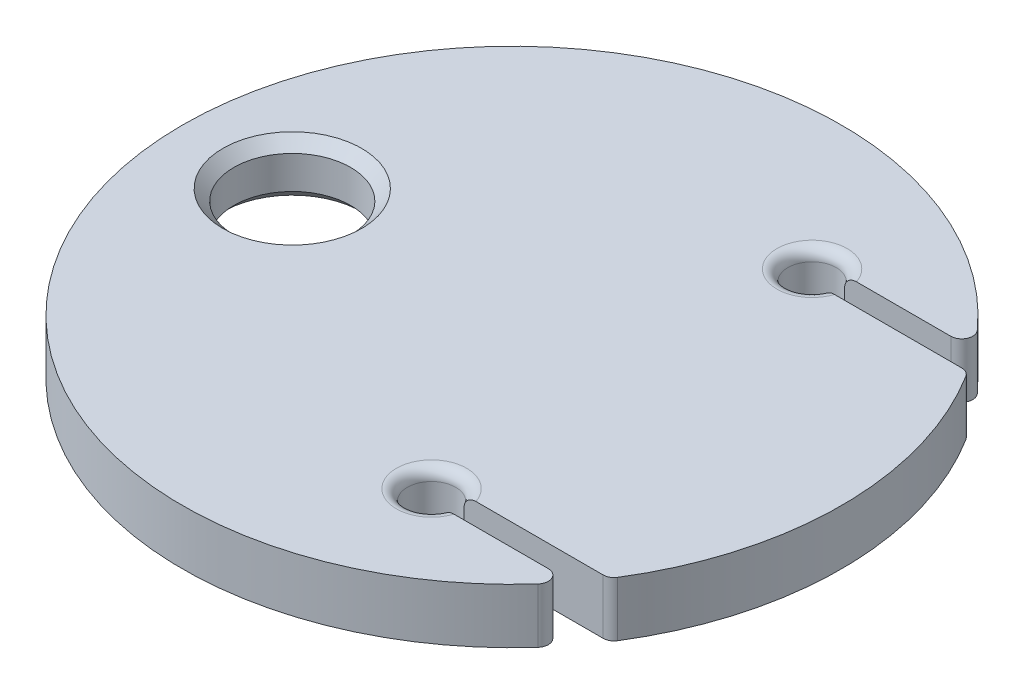
ISO-10303-21;
HEADER;
FILE_DESCRIPTION(('STEP AP214'),'2;1');
FILE_NAME('part.step','',(''),(''),'','','');
FILE_SCHEMA(('AUTOMOTIVE_DESIGN { 1 0 10303 214 1 1 1 1 }'));
ENDSEC;
DATA;
#1=APPLICATION_CONTEXT('core data for automotive mechanical design processes');
#2=APPLICATION_PROTOCOL_DEFINITION('international standard','automotive_design',2000,#1);
#3=PRODUCT_CONTEXT('',#1,'mechanical');
#4=PRODUCT('Part','Part','',(#3));
#5=PRODUCT_RELATED_PRODUCT_CATEGORY('part','',(#4));
#6=PRODUCT_DEFINITION_FORMATION('','',#4);
#7=PRODUCT_DEFINITION_CONTEXT('part definition',#1,'design');
#8=PRODUCT_DEFINITION('design','',#6,#7);
#9=PRODUCT_DEFINITION_SHAPE('','',#8);
#10=(LENGTH_UNIT() NAMED_UNIT(*) SI_UNIT(.MILLI.,.METRE.));
#11=(NAMED_UNIT(*) PLANE_ANGLE_UNIT() SI_UNIT($,.RADIAN.));
#12=(NAMED_UNIT(*) SI_UNIT($,.STERADIAN.) SOLID_ANGLE_UNIT());
#13=UNCERTAINTY_MEASURE_WITH_UNIT(LENGTH_MEASURE(1.E-05),#10,'distance_accuracy_value','');
#14=(GEOMETRIC_REPRESENTATION_CONTEXT(3) GLOBAL_UNCERTAINTY_ASSIGNED_CONTEXT((#13)) GLOBAL_UNIT_ASSIGNED_CONTEXT((#10,
#11,#12)) REPRESENTATION_CONTEXT('',''));
#15=CARTESIAN_POINT('',(0.,0.,0.));
#16=DIRECTION('',(0.,0.,1.));
#17=DIRECTION('',(1.,0.,0.));
#18=AXIS2_PLACEMENT_3D('',#15,#16,#17);
#19=CARTESIAN_POINT('',(0.,3.175,0.));
#20=DIRECTION('',(0.,-1.,0.));
#21=DIRECTION('',(0.,0.,-1.));
#22=AXIS2_PLACEMENT_3D('',#19,#20,#21);
#23=CYLINDRICAL_SURFACE('',#22,19.05);
#24=CARTESIAN_POINT('',(0.,0.,0.));
#25=DIRECTION('',(0.,1.,0.));
#26=DIRECTION('',(0.,0.,1.));
#27=AXIS2_PLACEMENT_3D('',#24,#25,#26);
#28=CIRCLE('',#27,19.05);
#29=CARTESIAN_POINT('',(16.1746291118457,0.,10.0639889255818));
#30=VERTEX_POINT('',#29);
#31=CARTESIAN_POINT('',(16.1746291118457,0.,-10.0639889255818));
#32=VERTEX_POINT('',#31);
#33=EDGE_CURVE('E316',#30,#32,#28,.T.);
#34=ORIENTED_EDGE('',*,*,#33,.T.);
#35=DIRECTION('',(0.,-1.,0.));
#36=VECTOR('',#35,1.);
#37=CARTESIAN_POINT('',(16.1746291118457,3.175,-10.0639889255818));
#38=LINE('',#37,#36);
#39=CARTESIAN_POINT('',(16.1746291118457,3.175,-10.0639889255818));
#40=VERTEX_POINT('',#39);
#41=EDGE_CURVE('E353',#32,#40,#38,.F.);
#42=ORIENTED_EDGE('',*,*,#41,.T.);
#43=CARTESIAN_POINT('',(0.,3.175,0.));
#44=DIRECTION('',(0.,1.,0.));
#45=DIRECTION('',(0.,0.,1.));
#46=AXIS2_PLACEMENT_3D('',#43,#44,#45);
#47=CIRCLE('',#46,19.05);
#48=CARTESIAN_POINT('',(16.1746291118457,3.175,10.0639889255818));
#49=VERTEX_POINT('',#48);
#50=EDGE_CURVE('E315',#49,#40,#47,.T.);
#51=ORIENTED_EDGE('',*,*,#50,.F.);
#52=DIRECTION('',(0.,-1.,0.));
#53=VECTOR('',#52,1.);
#54=CARTESIAN_POINT('',(16.1746291118457,3.175,10.0639889255818));
#55=LINE('',#54,#53);
#56=EDGE_CURVE('E420',#49,#30,#55,.T.);
#57=ORIENTED_EDGE('',*,*,#56,.T.);
#58=EDGE_LOOP('',(#34,#42,#51,#57));
#59=FACE_BOUND('',#58,.T.);
#60=ADVANCED_FACE('F35',(#59),#23,.T.);
#61=CARTESIAN_POINT('',(14.2065625911639,3.175,-12.6915751324783));
#62=VERTEX_POINT('',#61);
#63=CARTESIAN_POINT('',(14.2065625911639,3.175,12.6915751324783));
#64=VERTEX_POINT('',#63);
#65=EDGE_CURVE('E312',#62,#64,#47,.T.);
#66=ORIENTED_EDGE('',*,*,#65,.F.);
#67=DIRECTION('',(0.,-1.,0.));
#68=VECTOR('',#67,1.);
#69=CARTESIAN_POINT('',(14.2065625911639,3.175,-12.6915751324783));
#70=LINE('',#69,#68);
#71=CARTESIAN_POINT('',(14.2065625911639,0.,-12.6915751324783));
#72=VERTEX_POINT('',#71);
#73=EDGE_CURVE('E404',#62,#72,#70,.T.);
#74=ORIENTED_EDGE('',*,*,#73,.T.);
#75=CARTESIAN_POINT('',(14.2065625911639,0.,12.6915751324783));
#76=VERTEX_POINT('',#75);
#77=EDGE_CURVE('E311',#72,#76,#28,.T.);
#78=ORIENTED_EDGE('',*,*,#77,.T.);
#79=DIRECTION('',(0.,-1.,0.));
#80=VECTOR('',#79,1.);
#81=CARTESIAN_POINT('',(14.2065625911639,3.175,12.6915751324783));
#82=LINE('',#81,#80);
#83=EDGE_CURVE('E402',#76,#64,#82,.F.);
#84=ORIENTED_EDGE('',*,*,#83,.T.);
#85=EDGE_LOOP('',(#66,#74,#78,#84));
#86=FACE_BOUND('',#85,.T.);
#87=ADVANCED_FACE('F245',(#86),#23,.T.);
#88=CARTESIAN_POINT('',(0.,3.175,0.));
#89=DIRECTION('',(0.,1.,0.));
#90=DIRECTION('',(0.,0.,1.));
#91=AXIS2_PLACEMENT_3D('',#88,#89,#90);
#92=PLANE('',#91);
#93=CARTESIAN_POINT('',(-12.7,3.175,0.));
#94=DIRECTION('',(0.,1.,0.));
#95=DIRECTION('',(0.,0.,1.));
#96=AXIS2_PLACEMENT_3D('',#93,#94,#95);
#97=CIRCLE('',#96,4.01319999999999);
#98=CARTESIAN_POINT('',(-12.7,3.175,4.01319999999999));
#99=VERTEX_POINT('',#98);
#100=EDGE_CURVE('E325',#99,#99,#97,.F.);
#101=ORIENTED_EDGE('',*,*,#100,.T.);
#102=EDGE_LOOP('',(#101));
#103=FACE_BOUND('',#102,.T.);
#104=DIRECTION('',(1.,0.,0.));
#105=VECTOR('',#104,1.);
#106=CARTESIAN_POINT('',(0.,3.175,-11.6335226280624));
#107=LINE('',#106,#105);
#108=CARTESIAN_POINT('',(8.28023288750347,3.175,-11.6335226280624));
#109=VERTEX_POINT('',#108);
#110=CARTESIAN_POINT('',(13.7330105047918,3.175,-11.6335226280624));
#111=VERTEX_POINT('',#110);
#112=EDGE_CURVE('E154',#109,#111,#107,.T.);
#113=ORIENTED_EDGE('',*,*,#112,.T.);
#114=CARTESIAN_POINT('',(13.7330105047918,3.175,-12.2685226280624));
#115=DIRECTION('',(0.,1.,0.));
#116=DIRECTION('',(0.,0.,1.));
#117=AXIS2_PLACEMENT_3D('',#114,#115,#116);
#118=CIRCLE('',#117,0.635);
#119=EDGE_CURVE('E400',#111,#62,#118,.T.);
#120=ORIENTED_EDGE('',*,*,#119,.T.);
#121=ORIENTED_EDGE('',*,*,#65,.T.);
#122=CARTESIAN_POINT('',(13.7330105047918,3.175,12.2685226280624));
#123=DIRECTION('',(0.,1.,0.));
#124=DIRECTION('',(0.,0.,1.));
#125=AXIS2_PLACEMENT_3D('',#122,#123,#124);
#126=CIRCLE('',#125,0.635);
#127=CARTESIAN_POINT('',(13.7330105047918,3.175,11.6335226280624));
#128=VERTEX_POINT('',#127);
#129=EDGE_CURVE('E159',#64,#128,#126,.T.);
#130=ORIENTED_EDGE('',*,*,#129,.T.);
#131=DIRECTION('',(-1.,0.,0.));
#132=VECTOR('',#131,1.);
#133=CARTESIAN_POINT('',(0.,3.175,11.6335226280624));
#134=LINE('',#133,#132);
#135=CARTESIAN_POINT('',(8.28023288750347,3.175,11.6335226280624));
#136=VERTEX_POINT('',#135);
#137=EDGE_CURVE('E388',#128,#136,#134,.T.);
#138=ORIENTED_EDGE('',*,*,#137,.T.);
#139=CARTESIAN_POINT('',(6.35,3.175,10.9985226280624));
#140=DIRECTION('',(0.,1.,0.));
#141=DIRECTION('',(0.,0.,1.));
#142=AXIS2_PLACEMENT_3D('',#139,#140,#141);
#143=CIRCLE('',#142,2.032);
#144=CARTESIAN_POINT('',(8.28023288750347,3.175,10.3635226280624));
#145=VERTEX_POINT('',#144);
#146=EDGE_CURVE('E160',#136,#145,#143,.F.);
#147=ORIENTED_EDGE('',*,*,#146,.T.);
#148=DIRECTION('',(1.,0.,0.));
#149=VECTOR('',#148,1.);
#150=CARTESIAN_POINT('',(0.,3.175,10.3635226280624));
#151=LINE('',#150,#149);
#152=CARTESIAN_POINT('',(15.6354748081175,3.175,10.3635226280624));
#153=VERTEX_POINT('',#152);
#154=EDGE_CURVE('E302',#145,#153,#151,.T.);
#155=ORIENTED_EDGE('',*,*,#154,.T.);
#156=CARTESIAN_POINT('',(15.6354748081175,3.175,9.72852262806236));
#157=DIRECTION('',(0.,1.,0.));
#158=DIRECTION('',(0.,0.,1.));
#159=AXIS2_PLACEMENT_3D('',#156,#157,#158);
#160=CIRCLE('',#159,0.635);
#161=EDGE_CURVE('E396',#153,#49,#160,.T.);
#162=ORIENTED_EDGE('',*,*,#161,.T.);
#163=ORIENTED_EDGE('',*,*,#50,.T.);
#164=CARTESIAN_POINT('',(15.6354748081175,3.175,-9.72852262806236));
#165=DIRECTION('',(0.,1.,0.));
#166=DIRECTION('',(0.,0.,1.));
#167=AXIS2_PLACEMENT_3D('',#164,#165,#166);
#168=CIRCLE('',#167,0.635);
#169=CARTESIAN_POINT('',(15.6354748081175,3.175,-10.3635226280624));
#170=VERTEX_POINT('',#169);
#171=EDGE_CURVE('E398',#40,#170,#168,.T.);
#172=ORIENTED_EDGE('',*,*,#171,.T.);
#173=DIRECTION('',(-1.,0.,0.));
#174=VECTOR('',#173,1.);
#175=CARTESIAN_POINT('',(0.,3.175,-10.3635226280624));
#176=LINE('',#175,#174);
#177=CARTESIAN_POINT('',(8.28023288750347,3.175,-10.3635226280624));
#178=VERTEX_POINT('',#177);
#179=EDGE_CURVE('E156',#170,#178,#176,.T.);
#180=ORIENTED_EDGE('',*,*,#179,.T.);
#181=CARTESIAN_POINT('',(6.35,3.175,-10.9985226280624));
#182=DIRECTION('',(0.,1.,0.));
#183=DIRECTION('',(0.,0.,1.));
#184=AXIS2_PLACEMENT_3D('',#181,#182,#183);
#185=CIRCLE('',#184,2.032);
#186=EDGE_CURVE('E151',#178,#109,#185,.F.);
#187=ORIENTED_EDGE('',*,*,#186,.T.);
#188=EDGE_LOOP('',(#113,#120,#121,#130,#138,#147,#155,#162,#163,#172,#180,#187));
#189=FACE_BOUND('',#188,.T.);
#190=ADVANCED_FACE('F153',(#103,#189),#92,.T.);
#191=CARTESIAN_POINT('',(0.,0.,0.));
#192=DIRECTION('',(0.,1.,0.));
#193=DIRECTION('',(0.,0.,1.));
#194=AXIS2_PLACEMENT_3D('',#191,#192,#193);
#195=PLANE('',#194);
#196=CARTESIAN_POINT('',(-12.7,0.,0.));
#197=DIRECTION('',(0.,1.,0.));
#198=DIRECTION('',(0.,0.,1.));
#199=AXIS2_PLACEMENT_3D('',#196,#197,#198);
#200=CIRCLE('',#199,4.0132);
#201=CARTESIAN_POINT('',(-12.7,0.,4.0132));
#202=VERTEX_POINT('',#201);
#203=EDGE_CURVE('E328',#202,#202,#200,.T.);
#204=ORIENTED_EDGE('',*,*,#203,.T.);
#205=EDGE_LOOP('',(#204));
#206=FACE_BOUND('',#205,.T.);
#207=ORIENTED_EDGE('',*,*,#77,.F.);
#208=CARTESIAN_POINT('',(13.7330105047918,0.,-12.2685226280624));
#209=DIRECTION('',(0.,1.,0.));
#210=DIRECTION('',(0.,0.,1.));
#211=AXIS2_PLACEMENT_3D('',#208,#209,#210);
#212=CIRCLE('',#211,0.635);
#213=CARTESIAN_POINT('',(13.7330105047918,0.,-11.6335226280624));
#214=VERTEX_POINT('',#213);
#215=EDGE_CURVE('E215',#72,#214,#212,.F.);
#216=ORIENTED_EDGE('',*,*,#215,.T.);
#217=DIRECTION('',(1.,0.,0.));
#218=VECTOR('',#217,1.);
#219=CARTESIAN_POINT('',(0.,0.,-11.6335226280624));
#220=LINE('',#219,#218);
#221=CARTESIAN_POINT('',(8.28023288750347,0.,-11.6335226280624));
#222=VERTEX_POINT('',#221);
#223=EDGE_CURVE('E172',#222,#214,#220,.T.);
#224=ORIENTED_EDGE('',*,*,#223,.F.);
#225=CARTESIAN_POINT('',(6.35,0.,-10.9985226280624));
#226=DIRECTION('',(0.,1.,0.));
#227=DIRECTION('',(0.,0.,1.));
#228=AXIS2_PLACEMENT_3D('',#225,#226,#227);
#229=CIRCLE('',#228,2.032);
#230=CARTESIAN_POINT('',(8.28023288750347,0.,-10.3635226280624));
#231=VERTEX_POINT('',#230);
#232=EDGE_CURVE('E295',#222,#231,#229,.T.);
#233=ORIENTED_EDGE('',*,*,#232,.T.);
#234=DIRECTION('',(-1.,0.,0.));
#235=VECTOR('',#234,1.);
#236=CARTESIAN_POINT('',(0.,0.,-10.3635226280624));
#237=LINE('',#236,#235);
#238=CARTESIAN_POINT('',(15.6354748081175,0.,-10.3635226280624));
#239=VERTEX_POINT('',#238);
#240=EDGE_CURVE('E171',#239,#231,#237,.T.);
#241=ORIENTED_EDGE('',*,*,#240,.F.);
#242=CARTESIAN_POINT('',(15.6354748081175,0.,-9.72852262806236));
#243=DIRECTION('',(0.,1.,0.));
#244=DIRECTION('',(0.,0.,1.));
#245=AXIS2_PLACEMENT_3D('',#242,#243,#244);
#246=CIRCLE('',#245,0.635);
#247=EDGE_CURVE('E411',#239,#32,#246,.F.);
#248=ORIENTED_EDGE('',*,*,#247,.T.);
#249=ORIENTED_EDGE('',*,*,#33,.F.);
#250=CARTESIAN_POINT('',(15.6354748081175,0.,9.72852262806236));
#251=DIRECTION('',(0.,1.,0.));
#252=DIRECTION('',(0.,0.,1.));
#253=AXIS2_PLACEMENT_3D('',#250,#251,#252);
#254=CIRCLE('',#253,0.635);
#255=CARTESIAN_POINT('',(15.6354748081175,0.,10.3635226280624));
#256=VERTEX_POINT('',#255);
#257=EDGE_CURVE('E410',#30,#256,#254,.F.);
#258=ORIENTED_EDGE('',*,*,#257,.T.);
#259=DIRECTION('',(1.,0.,0.));
#260=VECTOR('',#259,1.);
#261=CARTESIAN_POINT('',(0.,0.,10.3635226280624));
#262=LINE('',#261,#260);
#263=CARTESIAN_POINT('',(8.28023288750347,0.,10.3635226280624));
#264=VERTEX_POINT('',#263);
#265=EDGE_CURVE('E305',#264,#256,#262,.T.);
#266=ORIENTED_EDGE('',*,*,#265,.F.);
#267=CARTESIAN_POINT('',(6.35,0.,10.9985226280624));
#268=DIRECTION('',(0.,1.,0.));
#269=DIRECTION('',(0.,0.,1.));
#270=AXIS2_PLACEMENT_3D('',#267,#268,#269);
#271=CIRCLE('',#270,2.032);
#272=CARTESIAN_POINT('',(8.28023288750347,0.,11.6335226280624));
#273=VERTEX_POINT('',#272);
#274=EDGE_CURVE('E348',#264,#273,#271,.T.);
#275=ORIENTED_EDGE('',*,*,#274,.T.);
#276=DIRECTION('',(-1.,0.,0.));
#277=VECTOR('',#276,1.);
#278=CARTESIAN_POINT('',(0.,0.,11.6335226280624));
#279=LINE('',#278,#277);
#280=CARTESIAN_POINT('',(13.7330105047918,0.,11.6335226280624));
#281=VERTEX_POINT('',#280);
#282=EDGE_CURVE('E391',#281,#273,#279,.T.);
#283=ORIENTED_EDGE('',*,*,#282,.F.);
#284=CARTESIAN_POINT('',(13.7330105047918,0.,12.2685226280624));
#285=DIRECTION('',(0.,1.,0.));
#286=DIRECTION('',(0.,0.,1.));
#287=AXIS2_PLACEMENT_3D('',#284,#285,#286);
#288=CIRCLE('',#287,0.635);
#289=EDGE_CURVE('E408',#281,#76,#288,.F.);
#290=ORIENTED_EDGE('',*,*,#289,.T.);
#291=EDGE_LOOP('',(#207,#216,#224,#233,#241,#248,#249,#258,#266,#275,#283,#290));
#292=FACE_BOUND('',#291,.T.);
#293=ADVANCED_FACE('F237',(#206,#292),#195,.F.);
#294=CARTESIAN_POINT('',(6.35,3.175,-10.9985226280624));
#295=DIRECTION('',(0.,1.,0.));
#296=DIRECTION('',(0.,0.,1.));
#297=AXIS2_PLACEMENT_3D('',#294,#295,#296);
#298=CYLINDRICAL_SURFACE('',#297,1.397);
#299=DIRECTION('',(0.,1.,0.));
#300=VECTOR('',#299,1.);
#301=CARTESIAN_POINT('',(7.59434078933385,3.175,-10.3635226280624));
#302=LINE('',#301,#300);
#303=CARTESIAN_POINT('',(7.59434078933385,0.635,-10.3635226280624));
#304=VERTEX_POINT('',#303);
#305=CARTESIAN_POINT('',(7.59434078933385,2.54,-10.3635226280624));
#306=VERTEX_POINT('',#305);
#307=EDGE_CURVE('E179',#304,#306,#302,.T.);
#308=ORIENTED_EDGE('',*,*,#307,.F.);
#309=CARTESIAN_POINT('',(6.35,0.635,-10.9985226280624));
#310=DIRECTION('',(0.,1.,0.));
#311=DIRECTION('',(0.,0.,1.));
#312=AXIS2_PLACEMENT_3D('',#309,#310,#311);
#313=CIRCLE('',#312,1.397);
#314=CARTESIAN_POINT('',(7.59434078933386,0.635,-11.6335226280624));
#315=VERTEX_POINT('',#314);
#316=EDGE_CURVE('E293',#304,#315,#313,.F.);
#317=ORIENTED_EDGE('',*,*,#316,.T.);
#318=DIRECTION('',(0.,1.,0.));
#319=VECTOR('',#318,1.);
#320=CARTESIAN_POINT('',(7.59434078933386,3.175,-11.6335226280624));
#321=LINE('',#320,#319);
#322=CARTESIAN_POINT('',(7.59434078933386,2.54,-11.6335226280624));
#323=VERTEX_POINT('',#322);
#324=EDGE_CURVE('E183',#323,#315,#321,.F.);
#325=ORIENTED_EDGE('',*,*,#324,.F.);
#326=CARTESIAN_POINT('',(6.35,2.54,-10.9985226280624));
#327=DIRECTION('',(0.,1.,0.));
#328=DIRECTION('',(0.,0.,1.));
#329=AXIS2_PLACEMENT_3D('',#326,#327,#328);
#330=CIRCLE('',#329,1.397);
#331=EDGE_CURVE('E177',#323,#306,#330,.T.);
#332=ORIENTED_EDGE('',*,*,#331,.T.);
#333=EDGE_LOOP('',(#308,#317,#325,#332));
#334=FACE_BOUND('',#333,.T.);
#335=ADVANCED_FACE('F233',(#334),#298,.F.);
#336=CARTESIAN_POINT('',(6.35,3.175,10.9985226280624));
#337=DIRECTION('',(0.,1.,0.));
#338=DIRECTION('',(0.,0.,1.));
#339=AXIS2_PLACEMENT_3D('',#336,#337,#338);
#340=CYLINDRICAL_SURFACE('',#339,1.397);
#341=DIRECTION('',(0.,1.,0.));
#342=VECTOR('',#341,1.);
#343=CARTESIAN_POINT('',(7.59434078933385,3.175,11.6335226280624));
#344=LINE('',#343,#342);
#345=CARTESIAN_POINT('',(7.59434078933385,0.635,11.6335226280624));
#346=VERTEX_POINT('',#345);
#347=CARTESIAN_POINT('',(7.59434078933385,2.54,11.6335226280624));
#348=VERTEX_POINT('',#347);
#349=EDGE_CURVE('E331',#346,#348,#344,.T.);
#350=ORIENTED_EDGE('',*,*,#349,.F.);
#351=CARTESIAN_POINT('',(6.35,0.635,10.9985226280624));
#352=DIRECTION('',(0.,1.,0.));
#353=DIRECTION('',(0.,0.,1.));
#354=AXIS2_PLACEMENT_3D('',#351,#352,#353);
#355=CIRCLE('',#354,1.397);
#356=CARTESIAN_POINT('',(7.59434078933385,0.635,10.3635226280624));
#357=VERTEX_POINT('',#356);
#358=EDGE_CURVE('E11',#346,#357,#355,.F.);
#359=ORIENTED_EDGE('',*,*,#358,.T.);
#360=DIRECTION('',(0.,1.,0.));
#361=VECTOR('',#360,1.);
#362=CARTESIAN_POINT('',(7.59434078933385,3.175,10.3635226280624));
#363=LINE('',#362,#361);
#364=CARTESIAN_POINT('',(7.59434078933385,2.54,10.3635226280624));
#365=VERTEX_POINT('',#364);
#366=EDGE_CURVE('E333',#365,#357,#363,.F.);
#367=ORIENTED_EDGE('',*,*,#366,.F.);
#368=CARTESIAN_POINT('',(6.35,2.54,10.9985226280624));
#369=DIRECTION('',(0.,1.,0.));
#370=DIRECTION('',(0.,0.,1.));
#371=AXIS2_PLACEMENT_3D('',#368,#369,#370);
#372=CIRCLE('',#371,1.397);
#373=EDGE_CURVE('E44',#365,#348,#372,.T.);
#374=ORIENTED_EDGE('',*,*,#373,.T.);
#375=EDGE_LOOP('',(#350,#359,#367,#374));
#376=FACE_BOUND('',#375,.T.);
#377=ADVANCED_FACE('F228',(#376),#340,.F.);
#378=CARTESIAN_POINT('',(-12.7,3.175,0.));
#379=DIRECTION('',(0.,1.,0.));
#380=DIRECTION('',(0.,0.,1.));
#381=AXIS2_PLACEMENT_3D('',#378,#379,#380);
#382=CYLINDRICAL_SURFACE('',#381,3.37819999999999);
#383=CARTESIAN_POINT('',(-12.7,2.54000000000001,0.));
#384=DIRECTION('',(0.,1.,0.));
#385=DIRECTION('',(0.,0.,1.));
#386=AXIS2_PLACEMENT_3D('',#383,#384,#385);
#387=CIRCLE('',#386,3.37819999999999);
#388=CARTESIAN_POINT('',(-12.7,2.54000000000001,3.37819999999999));
#389=VERTEX_POINT('',#388);
#390=EDGE_CURVE('E322',#389,#389,#387,.T.);
#391=ORIENTED_EDGE('',*,*,#390,.T.);
#392=EDGE_LOOP('',(#391));
#393=FACE_BOUND('',#392,.T.);
#394=CARTESIAN_POINT('',(-12.7,0.635000000000012,0.));
#395=DIRECTION('',(0.,1.,0.));
#396=DIRECTION('',(0.,0.,1.));
#397=AXIS2_PLACEMENT_3D('',#394,#395,#396);
#398=CIRCLE('',#397,3.37819999999999);
#399=CARTESIAN_POINT('',(-12.7,0.635000000000012,3.37819999999999));
#400=VERTEX_POINT('',#399);
#401=EDGE_CURVE('E319',#400,#400,#398,.F.);
#402=ORIENTED_EDGE('',*,*,#401,.T.);
#403=EDGE_LOOP('',(#402));
#404=FACE_BOUND('',#403,.T.);
#405=ADVANCED_FACE('F232',(#393,#404),#382,.F.);
#406=CARTESIAN_POINT('',(-12.7,2.54000000000001,0.));
#407=DIRECTION('',(0.,1.,0.));
#408=DIRECTION('',(0.,0.,1.));
#409=AXIS2_PLACEMENT_3D('',#406,#407,#408);
#410=CONICAL_SURFACE('',#409,3.37819999999999,0.78539816339745);
#411=ORIENTED_EDGE('',*,*,#100,.F.);
#412=EDGE_LOOP('',(#411));
#413=FACE_BOUND('',#412,.T.);
#414=ORIENTED_EDGE('',*,*,#390,.F.);
#415=EDGE_LOOP('',(#414));
#416=FACE_BOUND('',#415,.T.);
#417=ADVANCED_FACE('F241',(#413,#416),#410,.F.);
#418=CARTESIAN_POINT('',(-12.7,0.,0.));
#419=DIRECTION('',(0.,-1.,0.));
#420=DIRECTION('',(0.,0.,-1.));
#421=AXIS2_PLACEMENT_3D('',#418,#419,#420);
#422=CONICAL_SURFACE('',#421,4.0132,0.785398163397447);
#423=ORIENTED_EDGE('',*,*,#401,.F.);
#424=EDGE_LOOP('',(#423));
#425=FACE_BOUND('',#424,.T.);
#426=ORIENTED_EDGE('',*,*,#203,.F.);
#427=EDGE_LOOP('',(#426));
#428=FACE_BOUND('',#427,.T.);
#429=ADVANCED_FACE('F259',(#425,#428),#422,.F.);
#430=CARTESIAN_POINT('',(19.05,9.525,11.6335226280624));
#431=DIRECTION('',(0.,0.,-1.));
#432=DIRECTION('',(0.,1.,0.));
#433=AXIS2_PLACEMENT_3D('',#430,#431,#432);
#434=PLANE('',#433);
#435=ORIENTED_EDGE('',*,*,#137,.F.);
#436=DIRECTION('',(0.,1.,0.));
#437=VECTOR('',#436,1.);
#438=CARTESIAN_POINT('',(13.7330105047918,0.,11.6335226280624));
#439=LINE('',#438,#437);
#440=EDGE_CURVE('E382',#128,#281,#439,.F.);
#441=ORIENTED_EDGE('',*,*,#440,.T.);
#442=ORIENTED_EDGE('',*,*,#282,.T.);
#443=CARTESIAN_POINT('',(8.28023288750347,0.,11.6335226280624));
#444=CARTESIAN_POINT('',(8.24003438690035,-2.21269320664593E-05,11.6335226280624));
#445=CARTESIAN_POINT('',(8.19985840934196,0.00344295336007163,11.6335226280624));
#446=CARTESIAN_POINT('',(8.12066870343848,0.0170431238652638,11.6335226280624));
#447=CARTESIAN_POINT('',(8.08165441852798,0.0271749644950025,11.6335226280624));
#448=CARTESIAN_POINT('',(8.00586239124069,0.0538053842673953,11.6335226280624));
#449=CARTESIAN_POINT('',(7.96908474412375,0.0703042343655265,11.6335226280624));
#450=CARTESIAN_POINT('',(7.8988125909604,0.109245955348088,11.6335226280624));
#451=CARTESIAN_POINT('',(7.86531833505735,0.131689278627504,11.6335226280624));
#452=CARTESIAN_POINT('',(7.8027493522715,0.181958104965265,11.6335226280624));
#453=CARTESIAN_POINT('',(7.77366526401867,0.209771914383445,11.6335226280624));
#454=CARTESIAN_POINT('',(7.72094418328878,0.270186877449786,11.6335226280624));
#455=CARTESIAN_POINT('',(7.69730669811175,0.302787597636626,11.6335226280624));
#456=CARTESIAN_POINT('',(7.65793031503842,0.369716330188771,11.6335226280624));
#457=CARTESIAN_POINT('',(7.64178789229127,0.403806449680149,11.6335226280624));
#458=CARTESIAN_POINT('',(7.6162457395328,0.474391091982137,11.6335226280624));
#459=CARTESIAN_POINT('',(7.60682971160231,0.510879567517669,11.6335226280624));
#460=CARTESIAN_POINT('',(7.59883700028859,0.562299746204475,11.6335226280624));
#461=CARTESIAN_POINT('',(7.59715224081531,0.576795957194829,11.6335226280624));
#462=CARTESIAN_POINT('',(7.5949049880495,0.605858610372957,11.6335226280624));
#463=CARTESIAN_POINT('',(7.59434123017838,0.620424954821009,11.6335226280624));
#464=CARTESIAN_POINT('',(7.59434078933433,0.635000000000074,11.6335226280624));
#465=B_SPLINE_CURVE_WITH_KNOTS('',3,(#443,#444,#445,#446,#447,#448,#449,#450,#451,#452,#453,
#454,#455,#456,#457,#458,#459,#460,#461,#462,#463,#464),.UNSPECIFIED.,.F.,.F.,(4,2,2,2,2,2,2,2,
2,2,4),(0.,0.120415565877363,0.240772480953402,0.361134518522569,0.481505718692652,
0.601617720712957,0.721718853126811,0.834260177875563,0.946527883743154,0.990274356217807,
1.03397145114623),.UNSPECIFIED.);
#466=EDGE_CURVE('E59',#273,#346,#465,.T.);
#467=ORIENTED_EDGE('',*,*,#466,.T.);
#468=ORIENTED_EDGE('',*,*,#349,.T.);
#469=CARTESIAN_POINT('',(7.59434078933385,2.54,11.6335226280624));
#470=CARTESIAN_POINT('',(7.59433934518015,2.55664473665998,11.6335226280624));
#471=CARTESIAN_POINT('',(7.59507607049936,2.57328067840804,11.6335226280624));
#472=CARTESIAN_POINT('',(7.59800489610019,2.60641784350901,11.6335226280624));
#473=CARTESIAN_POINT('',(7.60019645262351,2.62291911486461,11.6335226280624));
#474=CARTESIAN_POINT('',(7.60889307811872,2.67189676748118,11.6335226280624));
#475=CARTESIAN_POINT('',(7.61752058523548,2.70401915374632,11.6335226280624));
#476=CARTESIAN_POINT('',(7.63998256678504,2.76631522583405,11.6335226280624));
#477=CARTESIAN_POINT('',(7.65381153182345,2.7964909341012,11.6335226280624));
#478=CARTESIAN_POINT('',(7.6860796537031,2.85429134295593,11.6335226280624));
#479=CARTESIAN_POINT('',(7.7045231442525,2.88191361190904,11.6335226280624));
#480=CARTESIAN_POINT('',(7.74649833260946,2.93550607667604,11.6335226280624));
#481=CARTESIAN_POINT('',(7.77025615954987,2.9612986528067,11.6335226280624));
#482=CARTESIAN_POINT('',(7.82142191536547,3.0089611654666,11.6335226280624));
#483=CARTESIAN_POINT('',(7.84883102709103,3.03082982541438,11.6335226280624));
#484=CARTESIAN_POINT('',(7.90935359801923,3.07216004909061,11.6335226280624));
#485=CARTESIAN_POINT('',(7.94276197482159,3.09119042570846,11.6335226280624));
#486=CARTESIAN_POINT('',(8.01218443586024,3.12367739667146,11.6335226280624));
#487=CARTESIAN_POINT('',(8.04819846504711,3.13713410873063,11.6335226280624));
#488=CARTESIAN_POINT('',(8.11675282731507,3.15667047716458,11.6335226280624));
#489=CARTESIAN_POINT('',(8.14907657239878,3.16351754170875,11.6335226280624));
#490=CARTESIAN_POINT('',(8.21433925146923,3.17268546974204,11.6335226280624));
#491=CARTESIAN_POINT('',(8.24727782039607,3.17500893796019,11.6335226280624));
#492=CARTESIAN_POINT('',(8.28023288750347,3.175,11.6335226280624));
#493=B_SPLINE_CURVE_WITH_KNOTS('',3,(#469,#470,#471,#472,#473,#474,#475,#476,#477,#478,#479,
#480,#481,#482,#483,#484,#485,#486,#487,#488,#489,#490,#491,#492),.UNSPECIFIED.,.F.,.F.,(4,2,2,
2,2,2,2,2,2,2,2,4),(0.,0.0499008744343684,0.0997831083913814,0.1990381695336,0.298188394231428,
0.39743208719521,0.50220158437098,0.60700510501814,0.721846969637837,0.836686408710008,
0.935500042613393,1.03425676185533),.UNSPECIFIED.);
#494=EDGE_CURVE('E51',#348,#136,#493,.T.);
#495=ORIENTED_EDGE('',*,*,#494,.T.);
#496=EDGE_LOOP('',(#435,#441,#442,#467,#468,#495));
#497=FACE_BOUND('',#496,.T.);
#498=ADVANCED_FACE('F265',(#497),#434,.T.);
#499=CARTESIAN_POINT('',(19.05,9.525,10.3635226280624));
#500=DIRECTION('',(0.,0.,1.));
#501=DIRECTION('',(0.,-1.,0.));
#502=AXIS2_PLACEMENT_3D('',#499,#500,#501);
#503=PLANE('',#502);
#504=ORIENTED_EDGE('',*,*,#265,.T.);
#505=DIRECTION('',(0.,1.,0.));
#506=VECTOR('',#505,1.);
#507=CARTESIAN_POINT('',(15.6354748081175,3.175,10.3635226280624));
#508=LINE('',#507,#506);
#509=EDGE_CURVE('E349',#256,#153,#508,.T.);
#510=ORIENTED_EDGE('',*,*,#509,.T.);
#511=ORIENTED_EDGE('',*,*,#154,.F.);
#512=CARTESIAN_POINT('',(8.28023288750347,3.175,10.3635226280624));
#513=CARTESIAN_POINT('',(8.24003438690034,3.17502212693207,10.3635226280624));
#514=CARTESIAN_POINT('',(8.19985840934196,3.17155704663993,10.3635226280624));
#515=CARTESIAN_POINT('',(8.12066870343848,3.15795687613473,10.3635226280624));
#516=CARTESIAN_POINT('',(8.08165441852797,3.147825035505,10.3635226280624));
#517=CARTESIAN_POINT('',(8.00586239124069,3.1211946157326,10.3635226280624));
#518=CARTESIAN_POINT('',(7.96908474412374,3.10469576563447,10.3635226280624));
#519=CARTESIAN_POINT('',(7.89881259096039,3.06575404465191,10.3635226280624));
#520=CARTESIAN_POINT('',(7.86531833505735,3.04331072137249,10.3635226280624));
#521=CARTESIAN_POINT('',(7.8027493522715,2.99304189503473,10.3635226280624));
#522=CARTESIAN_POINT('',(7.77366526401867,2.96522808561655,10.3635226280624));
#523=CARTESIAN_POINT('',(7.72094418328878,2.90481312255021,10.3635226280624));
#524=CARTESIAN_POINT('',(7.69730669811175,2.87221240236337,10.3635226280624));
#525=CARTESIAN_POINT('',(7.65793031503841,2.80528366981123,10.3635226280624));
#526=CARTESIAN_POINT('',(7.64178789229127,2.77119355031985,10.3635226280624));
#527=CARTESIAN_POINT('',(7.6162457395328,2.70060890801786,10.3635226280624));
#528=CARTESIAN_POINT('',(7.6068297116023,2.66412043248233,10.3635226280624));
#529=CARTESIAN_POINT('',(7.59883700028859,2.61270025379552,10.3635226280624));
#530=CARTESIAN_POINT('',(7.59715224081531,2.59820404280517,10.3635226280624));
#531=CARTESIAN_POINT('',(7.5949049880495,2.56914138962704,10.3635226280624));
#532=CARTESIAN_POINT('',(7.59434123017838,2.55457504517899,10.3635226280624));
#533=CARTESIAN_POINT('',(7.59434078933432,2.53999999999993,10.3635226280624));
#534=B_SPLINE_CURVE_WITH_KNOTS('',3,(#512,#513,#514,#515,#516,#517,#518,#519,#520,#521,#522,
#523,#524,#525,#526,#527,#528,#529,#530,#531,#532,#533),.UNSPECIFIED.,.F.,.F.,(4,2,2,2,2,2,2,2,
2,2,4),(0.,0.120415565877365,0.240772480953403,0.361134518522569,0.481505718692652,
0.601617720712956,0.721718853126811,0.834260177875563,0.946527883743154,0.990274356217807,
1.03397145114622),.UNSPECIFIED.);
#535=EDGE_CURVE('E344',#145,#365,#534,.T.);
#536=ORIENTED_EDGE('',*,*,#535,.T.);
#537=ORIENTED_EDGE('',*,*,#366,.T.);
#538=CARTESIAN_POINT('',(7.59434078933385,0.635,10.3635226280624));
#539=CARTESIAN_POINT('',(7.59433934518014,0.618355263340021,10.3635226280624));
#540=CARTESIAN_POINT('',(7.59507607049936,0.601719321591956,10.3635226280624));
#541=CARTESIAN_POINT('',(7.59800489610018,0.568582156490991,10.3635226280624));
#542=CARTESIAN_POINT('',(7.60019645262351,0.552080885135392,10.3635226280624));
#543=CARTESIAN_POINT('',(7.60889307811871,0.503103232518824,10.3635226280624));
#544=CARTESIAN_POINT('',(7.61752058523547,0.470980846253677,10.3635226280624));
#545=CARTESIAN_POINT('',(7.63998256678504,0.408684774165952,10.3635226280624));
#546=CARTESIAN_POINT('',(7.65381153182344,0.378509065898801,10.3635226280624));
#547=CARTESIAN_POINT('',(7.6860796537031,0.32070865704407,10.3635226280624));
#548=CARTESIAN_POINT('',(7.7045231442525,0.293086388090957,10.3635226280624));
#549=CARTESIAN_POINT('',(7.74649833260945,0.239493923323963,10.3635226280624));
#550=CARTESIAN_POINT('',(7.77025615954987,0.213701347193303,10.3635226280624));
#551=CARTESIAN_POINT('',(7.82142191536547,0.166038834533398,10.3635226280624));
#552=CARTESIAN_POINT('',(7.84883102709103,0.144170174585615,10.3635226280624));
#553=CARTESIAN_POINT('',(7.90935359801923,0.102839950909392,10.3635226280624));
#554=CARTESIAN_POINT('',(7.94276197482159,0.0838095742915366,10.3635226280624));
#555=CARTESIAN_POINT('',(8.01218443586024,0.0513226033285401,10.3635226280624));
#556=CARTESIAN_POINT('',(8.04819846504711,0.0378658912693676,10.3635226280624));
#557=CARTESIAN_POINT('',(8.11675282731506,0.018329522835419,10.3635226280624));
#558=CARTESIAN_POINT('',(8.14907657239877,0.011482458291245,10.3635226280624));
#559=CARTESIAN_POINT('',(8.21433925146923,0.00231453025796175,10.3635226280624));
#560=CARTESIAN_POINT('',(8.24727782039607,-8.93796019250527E-06,10.3635226280624));
#561=CARTESIAN_POINT('',(8.28023288750347,0.,10.3635226280624));
#562=B_SPLINE_CURVE_WITH_KNOTS('',3,(#538,#539,#540,#541,#542,#543,#544,#545,#546,#547,#548,
#549,#550,#551,#552,#553,#554,#555,#556,#557,#558,#559,#560,#561),.UNSPECIFIED.,.F.,.F.,(4,2,2,
2,2,2,2,2,2,2,2,4),(0.,0.0499008744343687,0.0997831083913815,0.1990381695336,0.298188394231428,
0.39743208719521,0.50220158437098,0.60700510501814,0.72184696963784,0.836686408710009,
0.935500042613393,1.03425676185533),.UNSPECIFIED.);
#563=EDGE_CURVE('E340',#357,#264,#562,.T.);
#564=ORIENTED_EDGE('',*,*,#563,.T.);
#565=EDGE_LOOP('',(#504,#510,#511,#536,#537,#564));
#566=FACE_BOUND('',#565,.T.);
#567=ADVANCED_FACE('F339',(#566),#503,.T.);
#568=CARTESIAN_POINT('',(19.05,-3.17500000000001,-11.6335226280624));
#569=DIRECTION('',(0.,0.,1.));
#570=DIRECTION('',(0.,-1.,0.));
#571=AXIS2_PLACEMENT_3D('',#568,#569,#570);
#572=PLANE('',#571);
#573=ORIENTED_EDGE('',*,*,#223,.T.);
#574=DIRECTION('',(0.,1.,0.));
#575=VECTOR('',#574,1.);
#576=CARTESIAN_POINT('',(13.7330105047918,3.175,-11.6335226280624));
#577=LINE('',#576,#575);
#578=EDGE_CURVE('E170',#214,#111,#577,.T.);
#579=ORIENTED_EDGE('',*,*,#578,.T.);
#580=ORIENTED_EDGE('',*,*,#112,.F.);
#581=CARTESIAN_POINT('',(8.28023288750347,3.175,-11.6335226280624));
#582=CARTESIAN_POINT('',(8.24003438690035,3.17502212693207,-11.6335226280624));
#583=CARTESIAN_POINT('',(8.19985840934196,3.17155704663993,-11.6335226280624));
#584=CARTESIAN_POINT('',(8.12066870343848,3.15795687613474,-11.6335226280624));
#585=CARTESIAN_POINT('',(8.08165441852798,3.147825035505,-11.6335226280624));
#586=CARTESIAN_POINT('',(8.00586239124069,3.1211946157326,-11.6335226280624));
#587=CARTESIAN_POINT('',(7.96908474412375,3.10469576563447,-11.6335226280624));
#588=CARTESIAN_POINT('',(7.8988125909604,3.06575404465191,-11.6335226280624));
#589=CARTESIAN_POINT('',(7.86531833505735,3.0433107213725,-11.6335226280624));
#590=CARTESIAN_POINT('',(7.8027493522715,2.99304189503474,-11.6335226280624));
#591=CARTESIAN_POINT('',(7.77366526401867,2.96522808561655,-11.6335226280624));
#592=CARTESIAN_POINT('',(7.72094418328878,2.90481312255021,-11.6335226280624));
#593=CARTESIAN_POINT('',(7.69730669811175,2.87221240236337,-11.6335226280624));
#594=CARTESIAN_POINT('',(7.65793031503842,2.80528366981123,-11.6335226280624));
#595=CARTESIAN_POINT('',(7.64178789229127,2.77119355031985,-11.6335226280624));
#596=CARTESIAN_POINT('',(7.6162457395328,2.70060890801786,-11.6335226280624));
#597=CARTESIAN_POINT('',(7.60682971160231,2.66412043248233,-11.6335226280624));
#598=CARTESIAN_POINT('',(7.59883700028859,2.61270025379552,-11.6335226280624));
#599=CARTESIAN_POINT('',(7.59715224081531,2.59820404280517,-11.6335226280624));
#600=CARTESIAN_POINT('',(7.5949049880495,2.56914138962704,-11.6335226280624));
#601=CARTESIAN_POINT('',(7.59434123017838,2.55457504517899,-11.6335226280624));
#602=CARTESIAN_POINT('',(7.59434078933433,2.53999999999993,-11.6335226280624));
#603=B_SPLINE_CURVE_WITH_KNOTS('',3,(#581,#582,#583,#584,#585,#586,#587,#588,#589,#590,#591,
#592,#593,#594,#595,#596,#597,#598,#599,#600,#601,#602),.UNSPECIFIED.,.F.,.F.,(4,2,2,2,2,2,2,2,
2,2,4),(0.,0.120415565877363,0.240772480953402,0.361134518522569,0.481505718692652,
0.601617720712956,0.721718853126811,0.834260177875563,0.946527883743153,0.990274356217807,
1.03397145114623),.UNSPECIFIED.);
#604=EDGE_CURVE('E167',#109,#323,#603,.T.);
#605=ORIENTED_EDGE('',*,*,#604,.T.);
#606=ORIENTED_EDGE('',*,*,#324,.T.);
#607=CARTESIAN_POINT('',(7.59434078933386,0.635,-11.6335226280624));
#608=CARTESIAN_POINT('',(7.59433934518015,0.618355263340021,-11.6335226280624));
#609=CARTESIAN_POINT('',(7.59507607049936,0.601719321591956,-11.6335226280624));
#610=CARTESIAN_POINT('',(7.59800489610019,0.568582156490991,-11.6335226280624));
#611=CARTESIAN_POINT('',(7.60019645262351,0.552080885135393,-11.6335226280624));
#612=CARTESIAN_POINT('',(7.60889307811872,0.503103232518824,-11.6335226280624));
#613=CARTESIAN_POINT('',(7.61752058523548,0.470980846253677,-11.6335226280624));
#614=CARTESIAN_POINT('',(7.63998256678504,0.408684774165952,-11.6335226280624));
#615=CARTESIAN_POINT('',(7.65381153182345,0.378509065898801,-11.6335226280624));
#616=CARTESIAN_POINT('',(7.6860796537031,0.32070865704407,-11.6335226280624));
#617=CARTESIAN_POINT('',(7.7045231442525,0.293086388090957,-11.6335226280624));
#618=CARTESIAN_POINT('',(7.74649833260946,0.239493923323963,-11.6335226280624));
#619=CARTESIAN_POINT('',(7.77025615954987,0.213701347193303,-11.6335226280624));
#620=CARTESIAN_POINT('',(7.82142191536547,0.166038834533398,-11.6335226280624));
#621=CARTESIAN_POINT('',(7.84883102709103,0.144170174585616,-11.6335226280624));
#622=CARTESIAN_POINT('',(7.90935359801923,0.102839950909393,-11.6335226280624));
#623=CARTESIAN_POINT('',(7.94276197482159,0.0838095742915371,-11.6335226280624));
#624=CARTESIAN_POINT('',(8.01218443586024,0.0513226033285404,-11.6335226280624));
#625=CARTESIAN_POINT('',(8.04819846504711,0.0378658912693677,-11.6335226280624));
#626=CARTESIAN_POINT('',(8.11675282731507,0.018329522835419,-11.6335226280624));
#627=CARTESIAN_POINT('',(8.14907657239878,0.011482458291245,-11.6335226280624));
#628=CARTESIAN_POINT('',(8.21433925146923,0.00231453025796179,-11.6335226280624));
#629=CARTESIAN_POINT('',(8.24727782039607,-8.93796019244768E-06,-11.6335226280624));
#630=CARTESIAN_POINT('',(8.28023288750347,0.,-11.6335226280624));
#631=B_SPLINE_CURVE_WITH_KNOTS('',3,(#607,#608,#609,#610,#611,#612,#613,#614,#615,#616,#617,
#618,#619,#620,#621,#622,#623,#624,#625,#626,#627,#628,#629,#630),.UNSPECIFIED.,.F.,.F.,(4,2,2,
2,2,2,2,2,2,2,2,4),(0.,0.0499008744343683,0.0997831083913812,0.1990381695336,0.298188394231428,
0.39743208719521,0.502201584370979,0.60700510501814,0.721846969637837,0.836686408710008,
0.935500042613393,1.03425676185533),.UNSPECIFIED.);
#632=EDGE_CURVE('E178',#315,#222,#631,.T.);
#633=ORIENTED_EDGE('',*,*,#632,.T.);
#634=EDGE_LOOP('',(#573,#579,#580,#605,#606,#633));
#635=FACE_BOUND('',#634,.T.);
#636=ADVANCED_FACE('F165',(#635),#572,.T.);
#637=CARTESIAN_POINT('',(19.05,-3.17500000000001,-10.3635226280624));
#638=DIRECTION('',(0.,0.,-1.));
#639=DIRECTION('',(-1.,0.,0.));
#640=AXIS2_PLACEMENT_3D('',#637,#638,#639);
#641=PLANE('',#640);
#642=ORIENTED_EDGE('',*,*,#179,.F.);
#643=DIRECTION('',(0.,1.,0.));
#644=VECTOR('',#643,1.);
#645=CARTESIAN_POINT('',(15.6354748081175,0.,-10.3635226280624));
#646=LINE('',#645,#644);
#647=EDGE_CURVE('E422',#170,#239,#646,.F.);
#648=ORIENTED_EDGE('',*,*,#647,.T.);
#649=ORIENTED_EDGE('',*,*,#240,.T.);
#650=CARTESIAN_POINT('',(8.28023288750347,0.,-10.3635226280624));
#651=CARTESIAN_POINT('',(8.24003438690034,-2.21269320663523E-05,-10.3635226280624));
#652=CARTESIAN_POINT('',(8.19985840934196,0.00344295336007183,-10.3635226280624));
#653=CARTESIAN_POINT('',(8.12066870343848,0.0170431238652642,-10.3635226280624));
#654=CARTESIAN_POINT('',(8.08165441852797,0.027174964495003,-10.3635226280624));
#655=CARTESIAN_POINT('',(8.00586239124069,0.0538053842673959,-10.3635226280624));
#656=CARTESIAN_POINT('',(7.96908474412374,0.0703042343655271,-10.3635226280624));
#657=CARTESIAN_POINT('',(7.89881259096039,0.109245955348089,-10.3635226280624));
#658=CARTESIAN_POINT('',(7.86531833505735,0.131689278627505,-10.3635226280624));
#659=CARTESIAN_POINT('',(7.8027493522715,0.181958104965265,-10.3635226280624));
#660=CARTESIAN_POINT('',(7.77366526401867,0.209771914383446,-10.3635226280624));
#661=CARTESIAN_POINT('',(7.72094418328878,0.270186877449787,-10.3635226280624));
#662=CARTESIAN_POINT('',(7.69730669811175,0.302787597636628,-10.3635226280624));
#663=CARTESIAN_POINT('',(7.65793031503841,0.369716330188773,-10.3635226280624));
#664=CARTESIAN_POINT('',(7.64178789229127,0.40380644968015,-10.3635226280624));
#665=CARTESIAN_POINT('',(7.6162457395328,0.474391091982138,-10.3635226280624));
#666=CARTESIAN_POINT('',(7.6068297116023,0.510879567517671,-10.3635226280624));
#667=CARTESIAN_POINT('',(7.59883700028859,0.562299746204477,-10.3635226280624));
#668=CARTESIAN_POINT('',(7.59715224081531,0.576795957194829,-10.3635226280624));
#669=CARTESIAN_POINT('',(7.5949049880495,0.605858610372958,-10.3635226280624));
#670=CARTESIAN_POINT('',(7.59434123017838,0.620424954821009,-10.3635226280624));
#671=CARTESIAN_POINT('',(7.59434078933432,0.635000000000073,-10.3635226280624));
#672=B_SPLINE_CURVE_WITH_KNOTS('',3,(#650,#651,#652,#653,#654,#655,#656,#657,#658,#659,#660,
#661,#662,#663,#664,#665,#666,#667,#668,#669,#670,#671),.UNSPECIFIED.,.F.,.F.,(4,2,2,2,2,2,2,2,
2,2,4),(0.,0.120415565877363,0.240772480953403,0.361134518522569,0.481505718692652,
0.601617720712957,0.721718853126812,0.834260177875564,0.946527883743155,0.990274356217807,
1.03397145114623),.UNSPECIFIED.);
#673=EDGE_CURVE('E214',#231,#304,#672,.T.);
#674=ORIENTED_EDGE('',*,*,#673,.T.);
#675=ORIENTED_EDGE('',*,*,#307,.T.);
#676=CARTESIAN_POINT('',(7.59434078933385,2.54,-10.3635226280624));
#677=CARTESIAN_POINT('',(7.59433934518014,2.55664473665998,-10.3635226280624));
#678=CARTESIAN_POINT('',(7.59507607049936,2.57328067840804,-10.3635226280624));
#679=CARTESIAN_POINT('',(7.59800489610018,2.60641784350901,-10.3635226280624));
#680=CARTESIAN_POINT('',(7.60019645262351,2.62291911486461,-10.3635226280624));
#681=CARTESIAN_POINT('',(7.60889307811871,2.67189676748118,-10.3635226280624));
#682=CARTESIAN_POINT('',(7.61752058523547,2.70401915374632,-10.3635226280624));
#683=CARTESIAN_POINT('',(7.63998256678504,2.76631522583405,-10.3635226280624));
#684=CARTESIAN_POINT('',(7.65381153182344,2.7964909341012,-10.3635226280624));
#685=CARTESIAN_POINT('',(7.6860796537031,2.85429134295593,-10.3635226280624));
#686=CARTESIAN_POINT('',(7.7045231442525,2.88191361190904,-10.3635226280624));
#687=CARTESIAN_POINT('',(7.74649833260945,2.93550607667604,-10.3635226280624));
#688=CARTESIAN_POINT('',(7.77025615954987,2.9612986528067,-10.3635226280624));
#689=CARTESIAN_POINT('',(7.82142191536547,3.0089611654666,-10.3635226280624));
#690=CARTESIAN_POINT('',(7.84883102709103,3.03082982541438,-10.3635226280624));
#691=CARTESIAN_POINT('',(7.90935359801923,3.07216004909061,-10.3635226280624));
#692=CARTESIAN_POINT('',(7.94276197482159,3.09119042570846,-10.3635226280624));
#693=CARTESIAN_POINT('',(8.01218443586024,3.12367739667146,-10.3635226280624));
#694=CARTESIAN_POINT('',(8.04819846504711,3.13713410873063,-10.3635226280624));
#695=CARTESIAN_POINT('',(8.11675282731506,3.15667047716458,-10.3635226280624));
#696=CARTESIAN_POINT('',(8.14907657239877,3.16351754170875,-10.3635226280624));
#697=CARTESIAN_POINT('',(8.21433925146923,3.17268546974204,-10.3635226280624));
#698=CARTESIAN_POINT('',(8.24727782039607,3.17500893796019,-10.3635226280624));
#699=CARTESIAN_POINT('',(8.28023288750347,3.175,-10.3635226280624));
#700=B_SPLINE_CURVE_WITH_KNOTS('',3,(#676,#677,#678,#679,#680,#681,#682,#683,#684,#685,#686,
#687,#688,#689,#690,#691,#692,#693,#694,#695,#696,#697,#698,#699),.UNSPECIFIED.,.F.,.F.,(4,2,2,
2,2,2,2,2,2,2,2,4),(0.,0.0499008744343683,0.0997831083913813,0.1990381695336,0.298188394231428,
0.39743208719521,0.502201584370979,0.607005105018141,0.72184696963784,0.836686408710008,
0.935500042613392,1.03425676185533),.UNSPECIFIED.);
#701=EDGE_CURVE('E207',#306,#178,#700,.T.);
#702=ORIENTED_EDGE('',*,*,#701,.T.);
#703=EDGE_LOOP('',(#642,#648,#649,#674,#675,#702));
#704=FACE_BOUND('',#703,.T.);
#705=ADVANCED_FACE('F222',(#704),#641,.T.);
#706=CARTESIAN_POINT('',(13.7330105047918,3.175,-12.2685226280624));
#707=DIRECTION('',(0.,-1.,0.));
#708=DIRECTION('',(0.,0.,-1.));
#709=AXIS2_PLACEMENT_3D('',#706,#707,#708);
#710=CYLINDRICAL_SURFACE('',#709,0.635);
#711=ORIENTED_EDGE('',*,*,#215,.F.);
#712=ORIENTED_EDGE('',*,*,#73,.F.);
#713=ORIENTED_EDGE('',*,*,#119,.F.);
#714=ORIENTED_EDGE('',*,*,#578,.F.);
#715=EDGE_LOOP('',(#711,#712,#713,#714));
#716=FACE_BOUND('',#715,.T.);
#717=ADVANCED_FACE('F226',(#716),#710,.T.);
#718=CARTESIAN_POINT('',(15.6354748081175,3.175,-9.72852262806236));
#719=DIRECTION('',(0.,-1.,0.));
#720=DIRECTION('',(0.,0.,-1.));
#721=AXIS2_PLACEMENT_3D('',#718,#719,#720);
#722=CYLINDRICAL_SURFACE('',#721,0.635);
#723=ORIENTED_EDGE('',*,*,#171,.F.);
#724=ORIENTED_EDGE('',*,*,#41,.F.);
#725=ORIENTED_EDGE('',*,*,#247,.F.);
#726=ORIENTED_EDGE('',*,*,#647,.F.);
#727=EDGE_LOOP('',(#723,#724,#725,#726));
#728=FACE_BOUND('',#727,.T.);
#729=ADVANCED_FACE('F269',(#728),#722,.T.);
#730=CARTESIAN_POINT('',(15.6354748081175,3.175,9.72852262806236));
#731=DIRECTION('',(0.,-1.,0.));
#732=DIRECTION('',(0.,0.,-1.));
#733=AXIS2_PLACEMENT_3D('',#730,#731,#732);
#734=CYLINDRICAL_SURFACE('',#733,0.635);
#735=ORIENTED_EDGE('',*,*,#257,.F.);
#736=ORIENTED_EDGE('',*,*,#56,.F.);
#737=ORIENTED_EDGE('',*,*,#161,.F.);
#738=ORIENTED_EDGE('',*,*,#509,.F.);
#739=EDGE_LOOP('',(#735,#736,#737,#738));
#740=FACE_BOUND('',#739,.T.);
#741=ADVANCED_FACE('F273',(#740),#734,.T.);
#742=CARTESIAN_POINT('',(13.7330105047918,3.175,12.2685226280624));
#743=DIRECTION('',(0.,-1.,0.));
#744=DIRECTION('',(0.,0.,-1.));
#745=AXIS2_PLACEMENT_3D('',#742,#743,#744);
#746=CYLINDRICAL_SURFACE('',#745,0.635);
#747=ORIENTED_EDGE('',*,*,#129,.F.);
#748=ORIENTED_EDGE('',*,*,#83,.F.);
#749=ORIENTED_EDGE('',*,*,#289,.F.);
#750=ORIENTED_EDGE('',*,*,#440,.F.);
#751=EDGE_LOOP('',(#747,#748,#749,#750));
#752=FACE_BOUND('',#751,.T.);
#753=ADVANCED_FACE('F277',(#752),#746,.T.);
#754=CARTESIAN_POINT('',(6.35,0.635,-10.9985226280624));
#755=DIRECTION('',(0.,1.,0.));
#756=DIRECTION('',(0.,0.,1.));
#757=AXIS2_PLACEMENT_3D('',#754,#755,#756);
#758=TOROIDAL_SURFACE('',#757,2.032,0.635);
#759=ORIENTED_EDGE('',*,*,#632,.F.);
#760=ORIENTED_EDGE('',*,*,#316,.F.);
#761=ORIENTED_EDGE('',*,*,#673,.F.);
#762=ORIENTED_EDGE('',*,*,#232,.F.);
#763=EDGE_LOOP('',(#759,#760,#761,#762));
#764=FACE_BOUND('',#763,.T.);
#765=ADVANCED_FACE('F280',(#764),#758,.T.);
#766=CARTESIAN_POINT('',(6.35,0.635,10.9985226280624));
#767=DIRECTION('',(0.,1.,0.));
#768=DIRECTION('',(0.,0.,1.));
#769=AXIS2_PLACEMENT_3D('',#766,#767,#768);
#770=TOROIDAL_SURFACE('',#769,2.032,0.635);
#771=ORIENTED_EDGE('',*,*,#563,.F.);
#772=ORIENTED_EDGE('',*,*,#358,.F.);
#773=ORIENTED_EDGE('',*,*,#466,.F.);
#774=ORIENTED_EDGE('',*,*,#274,.F.);
#775=EDGE_LOOP('',(#771,#772,#773,#774));
#776=FACE_BOUND('',#775,.T.);
#777=ADVANCED_FACE('F203',(#776),#770,.T.);
#778=CARTESIAN_POINT('',(6.35,2.54,-10.9985226280624));
#779=DIRECTION('',(0.,1.,0.));
#780=DIRECTION('',(0.,0.,1.));
#781=AXIS2_PLACEMENT_3D('',#778,#779,#780);
#782=TOROIDAL_SURFACE('',#781,2.032,0.635);
#783=ORIENTED_EDGE('',*,*,#604,.F.);
#784=ORIENTED_EDGE('',*,*,#186,.F.);
#785=ORIENTED_EDGE('',*,*,#701,.F.);
#786=ORIENTED_EDGE('',*,*,#331,.F.);
#787=EDGE_LOOP('',(#783,#784,#785,#786));
#788=FACE_BOUND('',#787,.T.);
#789=ADVANCED_FACE('F175',(#788),#782,.T.);
#790=CARTESIAN_POINT('',(6.35,2.54,10.9985226280624));
#791=DIRECTION('',(0.,1.,0.));
#792=DIRECTION('',(0.,0.,1.));
#793=AXIS2_PLACEMENT_3D('',#790,#791,#792);
#794=TOROIDAL_SURFACE('',#793,2.032,0.635);
#795=ORIENTED_EDGE('',*,*,#535,.F.);
#796=ORIENTED_EDGE('',*,*,#146,.F.);
#797=ORIENTED_EDGE('',*,*,#494,.F.);
#798=ORIENTED_EDGE('',*,*,#373,.F.);
#799=EDGE_LOOP('',(#795,#796,#797,#798));
#800=FACE_BOUND('',#799,.T.);
#801=ADVANCED_FACE('F37',(#800),#794,.T.);
#802=CLOSED_SHELL('',(#60,#87,#190,#293,#335,#377,#405,#417,#429,#498,#567,#636,#705,#717,#729,
#741,#753,#765,#777,#789,#801));
#803=MANIFOLD_SOLID_BREP('B2',#802);
#804=ADVANCED_BREP_SHAPE_REPRESENTATION('',(#18,#803),#14);
#805=SHAPE_DEFINITION_REPRESENTATION(#9,#804);
ENDSEC;
END-ISO-10303-21;
